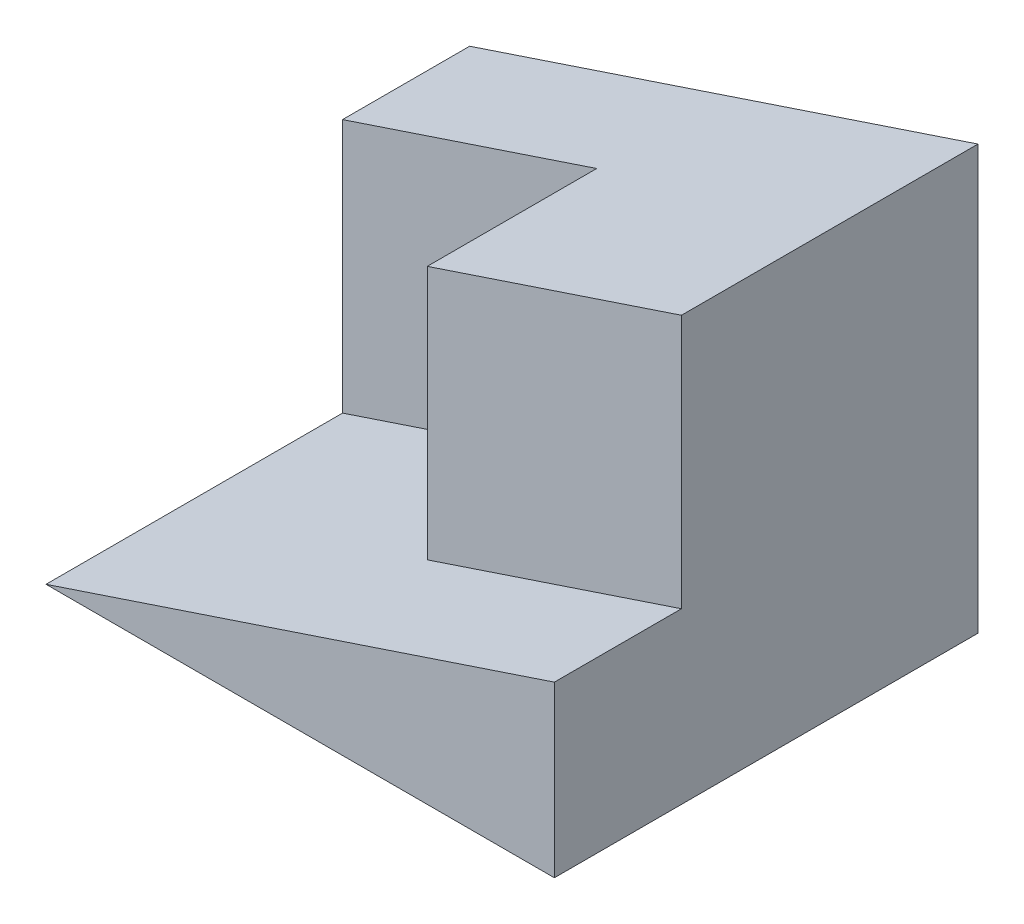
ISO-10303-21;
HEADER;
FILE_DESCRIPTION(('STEP AP214'),'2;1');
FILE_NAME('part.step','',(''),(''),'','','');
FILE_SCHEMA(('AUTOMOTIVE_DESIGN { 1 0 10303 214 1 1 1 1 }'));
ENDSEC;
DATA;
#1=APPLICATION_CONTEXT('core data for automotive mechanical design processes');
#2=APPLICATION_PROTOCOL_DEFINITION('international standard','automotive_design',2000,#1);
#3=PRODUCT_CONTEXT('',#1,'mechanical');
#4=PRODUCT('Part','Part','',(#3));
#5=PRODUCT_RELATED_PRODUCT_CATEGORY('part','',(#4));
#6=PRODUCT_DEFINITION_FORMATION('','',#4);
#7=PRODUCT_DEFINITION_CONTEXT('part definition',#1,'design');
#8=PRODUCT_DEFINITION('design','',#6,#7);
#9=PRODUCT_DEFINITION_SHAPE('','',#8);
#10=(LENGTH_UNIT() NAMED_UNIT(*) SI_UNIT(.MILLI.,.METRE.));
#11=(NAMED_UNIT(*) PLANE_ANGLE_UNIT() SI_UNIT($,.RADIAN.));
#12=(NAMED_UNIT(*) SI_UNIT($,.STERADIAN.) SOLID_ANGLE_UNIT());
#13=UNCERTAINTY_MEASURE_WITH_UNIT(LENGTH_MEASURE(1.E-05),#10,'distance_accuracy_value','');
#14=(GEOMETRIC_REPRESENTATION_CONTEXT(3) GLOBAL_UNCERTAINTY_ASSIGNED_CONTEXT((#13)) GLOBAL_UNIT_ASSIGNED_CONTEXT((#10,
#11,#12)) REPRESENTATION_CONTEXT('',''));
#15=CARTESIAN_POINT('',(0.,0.,0.));
#16=DIRECTION('',(0.,0.,1.));
#17=DIRECTION('',(1.,0.,0.));
#18=AXIS2_PLACEMENT_3D('',#15,#16,#17);
#19=CARTESIAN_POINT('',(-9.,27.,50.));
#20=DIRECTION('',(0.316227766016838,-0.948683298050514,0.));
#21=DIRECTION('',(0.948683298050514,0.316227766016838,0.));
#22=AXIS2_PLACEMENT_3D('',#19,#20,#21);
#23=PLANE('',#22);
#24=DIRECTION('',(0.,0.,1.));
#25=VECTOR('',#24,1.);
#26=CARTESIAN_POINT('',(30.,40.,15.));
#27=LINE('',#26,#25);
#28=CARTESIAN_POINT('',(30.,40.,15.));
#29=VERTEX_POINT('',#28);
#30=CARTESIAN_POINT('',(30.,40.,35.));
#31=VERTEX_POINT('',#30);
#32=EDGE_CURVE('E106',#29,#31,#27,.T.);
#33=ORIENTED_EDGE('',*,*,#32,.T.);
#34=DIRECTION('',(-0.948683298050514,-0.316227766016838,0.));
#35=VECTOR('',#34,1.);
#36=CARTESIAN_POINT('',(30.,40.,35.));
#37=LINE('',#36,#35);
#38=CARTESIAN_POINT('',(60.,50.,35.));
#39=VERTEX_POINT('',#38);
#40=EDGE_CURVE('E127',#39,#31,#37,.T.);
#41=ORIENTED_EDGE('',*,*,#40,.F.);
#42=DIRECTION('',(0.,0.,-1.));
#43=VECTOR('',#42,1.);
#44=CARTESIAN_POINT('',(60.,50.,50.));
#45=LINE('',#44,#43);
#46=CARTESIAN_POINT('',(60.,50.,0.));
#47=VERTEX_POINT('',#46);
#48=EDGE_CURVE('E12',#39,#47,#45,.T.);
#49=ORIENTED_EDGE('',*,*,#48,.T.);
#50=DIRECTION('',(-0.948683298050514,-0.316227766016838,0.));
#51=VECTOR('',#50,1.);
#52=CARTESIAN_POINT('',(-9.,27.,0.));
#53=LINE('',#52,#51);
#54=CARTESIAN_POINT('',(0.,30.,0.));
#55=VERTEX_POINT('',#54);
#56=EDGE_CURVE('E105',#47,#55,#53,.T.);
#57=ORIENTED_EDGE('',*,*,#56,.T.);
#58=DIRECTION('',(0.,0.,-1.));
#59=VECTOR('',#58,1.);
#60=CARTESIAN_POINT('',(0.,30.,50.));
#61=LINE('',#60,#59);
#62=CARTESIAN_POINT('',(0.,30.,15.));
#63=VERTEX_POINT('',#62);
#64=EDGE_CURVE('E46',#63,#55,#61,.T.);
#65=ORIENTED_EDGE('',*,*,#64,.F.);
#66=DIRECTION('',(-0.948683298050514,-0.316227766016838,0.));
#67=VECTOR('',#66,1.);
#68=CARTESIAN_POINT('',(-9.,27.,15.));
#69=LINE('',#68,#67);
#70=EDGE_CURVE('E151',#29,#63,#69,.T.);
#71=ORIENTED_EDGE('',*,*,#70,.F.);
#72=EDGE_LOOP('',(#33,#41,#49,#57,#65,#71));
#73=FACE_BOUND('',#72,.T.);
#74=ADVANCED_FACE('F38',(#73),#23,.F.);
#75=CARTESIAN_POINT('',(0.,0.,50.));
#76=DIRECTION('',(-1.,0.,0.));
#77=DIRECTION('',(0.,0.,1.));
#78=AXIS2_PLACEMENT_3D('',#75,#76,#77);
#79=PLANE('',#78);
#80=DIRECTION('',(0.,0.,-1.));
#81=VECTOR('',#80,1.);
#82=CARTESIAN_POINT('',(0.,0.,50.));
#83=LINE('',#82,#81);
#84=CARTESIAN_POINT('',(0.,0.,15.));
#85=VERTEX_POINT('',#84);
#86=CARTESIAN_POINT('',(0.,0.,0.));
#87=VERTEX_POINT('',#86);
#88=EDGE_CURVE('E87',#85,#87,#83,.T.);
#89=ORIENTED_EDGE('',*,*,#88,.F.);
#90=DIRECTION('',(0.,-1.,0.));
#91=VECTOR('',#90,1.);
#92=CARTESIAN_POINT('',(0.,0.,15.));
#93=LINE('',#92,#91);
#94=EDGE_CURVE('E122',#63,#85,#93,.T.);
#95=ORIENTED_EDGE('',*,*,#94,.F.);
#96=ORIENTED_EDGE('',*,*,#64,.T.);
#97=DIRECTION('',(0.,1.,0.));
#98=VECTOR('',#97,1.);
#99=CARTESIAN_POINT('',(0.,0.,0.));
#100=LINE('',#99,#98);
#101=EDGE_CURVE('E93',#87,#55,#100,.T.);
#102=ORIENTED_EDGE('',*,*,#101,.F.);
#103=EDGE_LOOP('',(#89,#95,#96,#102));
#104=FACE_BOUND('',#103,.T.);
#105=ADVANCED_FACE('F120',(#104),#79,.T.);
#106=CARTESIAN_POINT('',(0.,0.,50.));
#107=DIRECTION('',(0.,0.,1.));
#108=DIRECTION('',(1.,0.,0.));
#109=AXIS2_PLACEMENT_3D('',#106,#107,#108);
#110=PLANE('',#109);
#111=DIRECTION('',(0.,1.,0.));
#112=VECTOR('',#111,1.);
#113=CARTESIAN_POINT('',(60.,0.,50.));
#114=LINE('',#113,#112);
#115=CARTESIAN_POINT('',(60.,0.,50.));
#116=VERTEX_POINT('',#115);
#117=CARTESIAN_POINT('',(60.,20.,50.));
#118=VERTEX_POINT('',#117);
#119=EDGE_CURVE('E92',#116,#118,#114,.T.);
#120=ORIENTED_EDGE('',*,*,#119,.T.);
#121=DIRECTION('',(0.948683298050514,0.316227766016838,0.));
#122=VECTOR('',#121,1.);
#123=CARTESIAN_POINT('',(0.,0.,50.));
#124=LINE('',#123,#122);
#125=CARTESIAN_POINT('',(0.,0.,50.));
#126=VERTEX_POINT('',#125);
#127=EDGE_CURVE('E162',#126,#118,#124,.T.);
#128=ORIENTED_EDGE('',*,*,#127,.F.);
#129=DIRECTION('',(1.,0.,0.));
#130=VECTOR('',#129,1.);
#131=CARTESIAN_POINT('',(0.,0.,50.));
#132=LINE('',#131,#130);
#133=EDGE_CURVE('E62',#126,#116,#132,.T.);
#134=ORIENTED_EDGE('',*,*,#133,.T.);
#135=EDGE_LOOP('',(#120,#128,#134));
#136=FACE_BOUND('',#135,.T.);
#137=ADVANCED_FACE('F164',(#136),#110,.T.);
#138=CARTESIAN_POINT('',(60.,0.,50.));
#139=DIRECTION('',(-1.,0.,0.));
#140=DIRECTION('',(0.,0.,1.));
#141=AXIS2_PLACEMENT_3D('',#138,#139,#140);
#142=PLANE('',#141);
#143=DIRECTION('',(0.,1.,0.));
#144=VECTOR('',#143,1.);
#145=CARTESIAN_POINT('',(60.,50.,35.));
#146=LINE('',#145,#144);
#147=CARTESIAN_POINT('',(60.,20.,35.));
#148=VERTEX_POINT('',#147);
#149=EDGE_CURVE('E130',#148,#39,#146,.T.);
#150=ORIENTED_EDGE('',*,*,#149,.F.);
#151=DIRECTION('',(0.,0.,1.));
#152=VECTOR('',#151,1.);
#153=CARTESIAN_POINT('',(60.,20.,35.));
#154=LINE('',#153,#152);
#155=EDGE_CURVE('E163',#148,#118,#154,.T.);
#156=ORIENTED_EDGE('',*,*,#155,.T.);
#157=ORIENTED_EDGE('',*,*,#119,.F.);
#158=DIRECTION('',(0.,0.,-1.));
#159=VECTOR('',#158,1.);
#160=CARTESIAN_POINT('',(60.,0.,50.));
#161=LINE('',#160,#159);
#162=CARTESIAN_POINT('',(60.,0.,0.));
#163=VERTEX_POINT('',#162);
#164=EDGE_CURVE('E83',#116,#163,#161,.T.);
#165=ORIENTED_EDGE('',*,*,#164,.T.);
#166=DIRECTION('',(0.,1.,0.));
#167=VECTOR('',#166,1.);
#168=CARTESIAN_POINT('',(60.,0.,0.));
#169=LINE('',#168,#167);
#170=EDGE_CURVE('E99',#163,#47,#169,.T.);
#171=ORIENTED_EDGE('',*,*,#170,.T.);
#172=ORIENTED_EDGE('',*,*,#48,.F.);
#173=EDGE_LOOP('',(#150,#156,#157,#165,#171,#172));
#174=FACE_BOUND('',#173,.T.);
#175=ADVANCED_FACE('F40',(#174),#142,.F.);
#176=CARTESIAN_POINT('',(0.,0.,50.));
#177=DIRECTION('',(0.,1.,0.));
#178=DIRECTION('',(0.,0.,1.));
#179=AXIS2_PLACEMENT_3D('',#176,#177,#178);
#180=PLANE('',#179);
#181=DIRECTION('',(1.,0.,0.));
#182=VECTOR('',#181,1.);
#183=CARTESIAN_POINT('',(0.,0.,0.));
#184=LINE('',#183,#182);
#185=EDGE_CURVE('E80',#87,#163,#184,.T.);
#186=ORIENTED_EDGE('',*,*,#185,.T.);
#187=ORIENTED_EDGE('',*,*,#164,.F.);
#188=ORIENTED_EDGE('',*,*,#133,.F.);
#189=EDGE_CURVE('E116',#126,#85,#83,.T.);
#190=ORIENTED_EDGE('',*,*,#189,.T.);
#191=ORIENTED_EDGE('',*,*,#88,.T.);
#192=EDGE_LOOP('',(#186,#187,#188,#190,#191));
#193=FACE_BOUND('',#192,.T.);
#194=ADVANCED_FACE('F82',(#193),#180,.F.);
#195=CARTESIAN_POINT('',(0.,0.,0.));
#196=DIRECTION('',(0.,0.,1.));
#197=DIRECTION('',(1.,0.,0.));
#198=AXIS2_PLACEMENT_3D('',#195,#196,#197);
#199=PLANE('',#198);
#200=ORIENTED_EDGE('',*,*,#170,.F.);
#201=ORIENTED_EDGE('',*,*,#185,.F.);
#202=ORIENTED_EDGE('',*,*,#101,.T.);
#203=ORIENTED_EDGE('',*,*,#56,.F.);
#204=EDGE_LOOP('',(#200,#201,#202,#203));
#205=FACE_BOUND('',#204,.T.);
#206=ADVANCED_FACE('F103',(#205),#199,.F.);
#207=CARTESIAN_POINT('',(30.,0.,15.));
#208=DIRECTION('',(-1.,0.,0.));
#209=DIRECTION('',(0.,-1.,0.));
#210=AXIS2_PLACEMENT_3D('',#207,#208,#209);
#211=PLANE('',#210);
#212=DIRECTION('',(0.,-1.,0.));
#213=VECTOR('',#212,1.);
#214=CARTESIAN_POINT('',(30.,10.,35.));
#215=LINE('',#214,#213);
#216=CARTESIAN_POINT('',(30.,10.,35.));
#217=VERTEX_POINT('',#216);
#218=EDGE_CURVE('E53',#31,#217,#215,.T.);
#219=ORIENTED_EDGE('',*,*,#218,.F.);
#220=ORIENTED_EDGE('',*,*,#32,.F.);
#221=DIRECTION('',(0.,-1.,0.));
#222=VECTOR('',#221,1.);
#223=CARTESIAN_POINT('',(30.,0.,15.));
#224=LINE('',#223,#222);
#225=CARTESIAN_POINT('',(30.,10.,15.));
#226=VERTEX_POINT('',#225);
#227=EDGE_CURVE('E154',#29,#226,#224,.T.);
#228=ORIENTED_EDGE('',*,*,#227,.T.);
#229=DIRECTION('',(0.,0.,1.));
#230=VECTOR('',#229,1.);
#231=CARTESIAN_POINT('',(30.,10.,15.));
#232=LINE('',#231,#230);
#233=EDGE_CURVE('E110',#226,#217,#232,.T.);
#234=ORIENTED_EDGE('',*,*,#233,.T.);
#235=EDGE_LOOP('',(#219,#220,#228,#234));
#236=FACE_BOUND('',#235,.T.);
#237=ADVANCED_FACE('F177',(#236),#211,.T.);
#238=CARTESIAN_POINT('',(0.,0.,15.));
#239=DIRECTION('',(0.316227766016838,-0.948683298050514,0.));
#240=DIRECTION('',(0.948683298050514,0.316227766016838,0.));
#241=AXIS2_PLACEMENT_3D('',#238,#239,#240);
#242=PLANE('',#241);
#243=ORIENTED_EDGE('',*,*,#127,.T.);
#244=ORIENTED_EDGE('',*,*,#155,.F.);
#245=DIRECTION('',(0.948683298050514,0.316227766016838,0.));
#246=VECTOR('',#245,1.);
#247=CARTESIAN_POINT('',(60.,20.,35.));
#248=LINE('',#247,#246);
#249=EDGE_CURVE('E173',#217,#148,#248,.T.);
#250=ORIENTED_EDGE('',*,*,#249,.F.);
#251=ORIENTED_EDGE('',*,*,#233,.F.);
#252=DIRECTION('',(0.948683298050514,0.316227766016838,0.));
#253=VECTOR('',#252,1.);
#254=CARTESIAN_POINT('',(0.,0.,15.));
#255=LINE('',#254,#253);
#256=EDGE_CURVE('E158',#85,#226,#255,.T.);
#257=ORIENTED_EDGE('',*,*,#256,.F.);
#258=ORIENTED_EDGE('',*,*,#189,.F.);
#259=EDGE_LOOP('',(#243,#244,#250,#251,#257,#258));
#260=FACE_BOUND('',#259,.T.);
#261=ADVANCED_FACE('F166',(#260),#242,.F.);
#262=CARTESIAN_POINT('',(0.,0.,15.));
#263=DIRECTION('',(0.,0.,1.));
#264=DIRECTION('',(1.,0.,0.));
#265=AXIS2_PLACEMENT_3D('',#262,#263,#264);
#266=PLANE('',#265);
#267=ORIENTED_EDGE('',*,*,#94,.T.);
#268=ORIENTED_EDGE('',*,*,#256,.T.);
#269=ORIENTED_EDGE('',*,*,#227,.F.);
#270=ORIENTED_EDGE('',*,*,#70,.T.);
#271=EDGE_LOOP('',(#267,#268,#269,#270));
#272=FACE_BOUND('',#271,.T.);
#273=ADVANCED_FACE('F152',(#272),#266,.T.);
#274=CARTESIAN_POINT('',(0.,0.,35.));
#275=DIRECTION('',(0.,0.,-1.));
#276=DIRECTION('',(-1.,0.,0.));
#277=AXIS2_PLACEMENT_3D('',#274,#275,#276);
#278=PLANE('',#277);
#279=ORIENTED_EDGE('',*,*,#218,.T.);
#280=ORIENTED_EDGE('',*,*,#249,.T.);
#281=ORIENTED_EDGE('',*,*,#149,.T.);
#282=ORIENTED_EDGE('',*,*,#40,.T.);
#283=EDGE_LOOP('',(#279,#280,#281,#282));
#284=FACE_BOUND('',#283,.T.);
#285=ADVANCED_FACE('F175',(#284),#278,.F.);
#286=CLOSED_SHELL('',(#74,#105,#137,#175,#194,#206,#237,#261,#273,#285));
#287=MANIFOLD_SOLID_BREP('B2',#286);
#288=ADVANCED_BREP_SHAPE_REPRESENTATION('',(#18,#287),#14);
#289=SHAPE_DEFINITION_REPRESENTATION(#9,#288);
ENDSEC;
END-ISO-10303-21;
